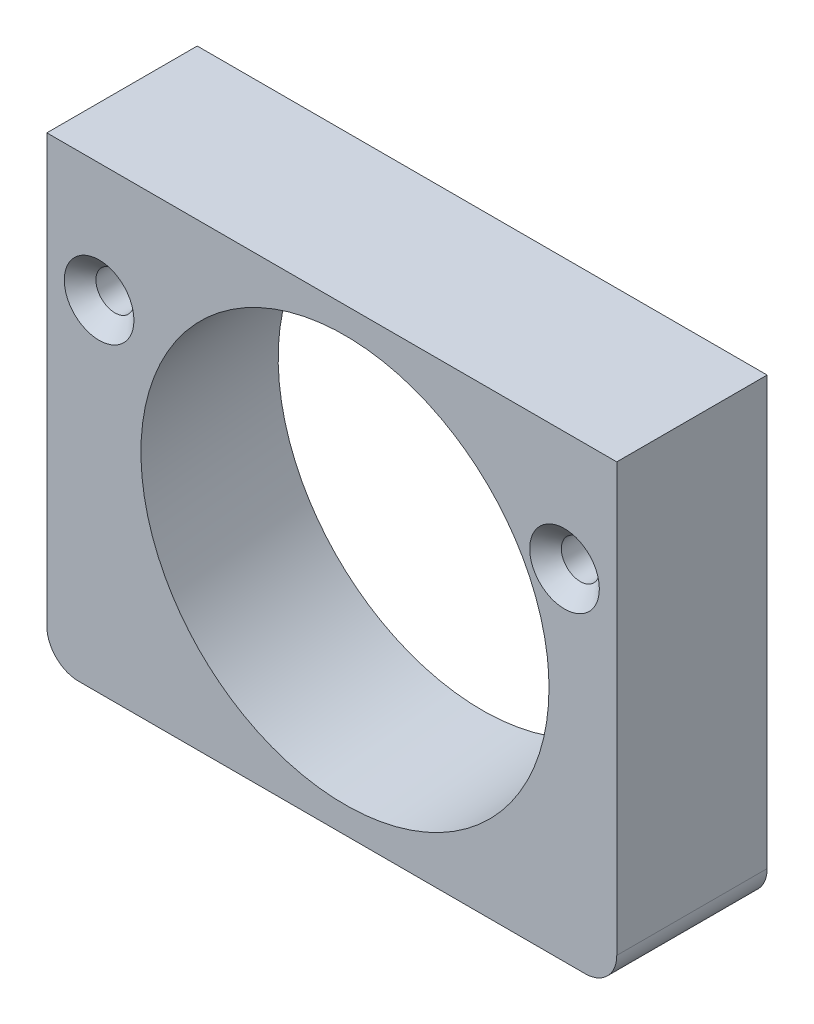
ISO-10303-21;
HEADER;
FILE_DESCRIPTION(('STEP AP214'),'2;1');
FILE_NAME('part.step','',(''),(''),'','','');
FILE_SCHEMA(('AUTOMOTIVE_DESIGN { 1 0 10303 214 1 1 1 1 }'));
ENDSEC;
DATA;
#1=APPLICATION_CONTEXT('core data for automotive mechanical design processes');
#2=APPLICATION_PROTOCOL_DEFINITION('international standard','automotive_design',2000,#1);
#3=PRODUCT_CONTEXT('',#1,'mechanical');
#4=PRODUCT('Part','Part','',(#3));
#5=PRODUCT_RELATED_PRODUCT_CATEGORY('part','',(#4));
#6=PRODUCT_DEFINITION_FORMATION('','',#4);
#7=PRODUCT_DEFINITION_CONTEXT('part definition',#1,'design');
#8=PRODUCT_DEFINITION('design','',#6,#7);
#9=PRODUCT_DEFINITION_SHAPE('','',#8);
#10=(LENGTH_UNIT() NAMED_UNIT(*) SI_UNIT(.MILLI.,.METRE.));
#11=(NAMED_UNIT(*) PLANE_ANGLE_UNIT() SI_UNIT($,.RADIAN.));
#12=(NAMED_UNIT(*) SI_UNIT($,.STERADIAN.) SOLID_ANGLE_UNIT());
#13=UNCERTAINTY_MEASURE_WITH_UNIT(LENGTH_MEASURE(1.E-05),#10,'distance_accuracy_value','');
#14=(GEOMETRIC_REPRESENTATION_CONTEXT(3) GLOBAL_UNCERTAINTY_ASSIGNED_CONTEXT((#13)) GLOBAL_UNIT_ASSIGNED_CONTEXT((#10,
#11,#12)) REPRESENTATION_CONTEXT('',''));
#15=CARTESIAN_POINT('',(0.,0.,0.));
#16=DIRECTION('',(0.,0.,1.));
#17=DIRECTION('',(1.,0.,0.));
#18=AXIS2_PLACEMENT_3D('',#15,#16,#17);
#19=CARTESIAN_POINT('',(-16.,-12.5,9.5));
#20=DIRECTION('',(0.,0.,-1.));
#21=DIRECTION('',(-1.,0.,0.));
#22=AXIS2_PLACEMENT_3D('',#19,#20,#21);
#23=PLANE('',#22);
#24=CARTESIAN_POINT('',(0.83114230349628,0.,9.5));
#25=DIRECTION('',(0.,0.,-1.));
#26=DIRECTION('',(1.,0.,0.));
#27=AXIS2_PLACEMENT_3D('',#24,#25,#26);
#28=ELLIPSE('',#27,12.8887455681053,12.8397);
#29=CARTESIAN_POINT('',(13.7198878716016,0.,9.5));
#30=VERTEX_POINT('',#29);
#31=EDGE_CURVE('E123',#30,#30,#28,.F.);
#32=ORIENTED_EDGE('',*,*,#31,.F.);
#33=EDGE_LOOP('',(#32));
#34=FACE_BOUND('',#33,.T.);
#35=DIRECTION('',(0.,1.,0.));
#36=VECTOR('',#35,1.);
#37=CARTESIAN_POINT('',(18.,-12.5,9.5));
#38=LINE('',#37,#36);
#39=CARTESIAN_POINT('',(18.,-12.5,9.5));
#40=VERTEX_POINT('',#39);
#41=CARTESIAN_POINT('',(18.,14.5,9.5));
#42=VERTEX_POINT('',#41);
#43=EDGE_CURVE('E130',#40,#42,#38,.T.);
#44=ORIENTED_EDGE('',*,*,#43,.T.);
#45=DIRECTION('',(-1.,0.,0.));
#46=VECTOR('',#45,1.);
#47=CARTESIAN_POINT('',(-18.,14.5,9.5));
#48=LINE('',#47,#46);
#49=CARTESIAN_POINT('',(-18.,14.5,9.5));
#50=VERTEX_POINT('',#49);
#51=EDGE_CURVE('E88',#42,#50,#48,.T.);
#52=ORIENTED_EDGE('',*,*,#51,.T.);
#53=DIRECTION('',(0.,-1.,0.));
#54=VECTOR('',#53,1.);
#55=CARTESIAN_POINT('',(-18.,-12.5,9.5));
#56=LINE('',#55,#54);
#57=CARTESIAN_POINT('',(-18.,-12.5,9.5));
#58=VERTEX_POINT('',#57);
#59=EDGE_CURVE('E101',#50,#58,#56,.T.);
#60=ORIENTED_EDGE('',*,*,#59,.T.);
#61=CARTESIAN_POINT('',(-16.,-12.5,9.5));
#62=DIRECTION('',(0.,0.,1.));
#63=DIRECTION('',(-1.,0.,0.));
#64=AXIS2_PLACEMENT_3D('',#61,#62,#63);
#65=CIRCLE('',#64,2.);
#66=CARTESIAN_POINT('',(-16.,-14.5,9.5));
#67=VERTEX_POINT('',#66);
#68=EDGE_CURVE('E95',#58,#67,#65,.T.);
#69=ORIENTED_EDGE('',*,*,#68,.T.);
#70=DIRECTION('',(1.,0.,0.));
#71=VECTOR('',#70,1.);
#72=CARTESIAN_POINT('',(-16.,-14.5,9.5));
#73=LINE('',#72,#71);
#74=CARTESIAN_POINT('',(16.,-14.5,9.5));
#75=VERTEX_POINT('',#74);
#76=EDGE_CURVE('E99',#67,#75,#73,.T.);
#77=ORIENTED_EDGE('',*,*,#76,.T.);
#78=CARTESIAN_POINT('',(16.,-12.5,9.5));
#79=DIRECTION('',(0.,0.,1.));
#80=DIRECTION('',(1.,0.,0.));
#81=AXIS2_PLACEMENT_3D('',#78,#79,#80);
#82=CIRCLE('',#81,2.);
#83=EDGE_CURVE('E51',#75,#40,#82,.T.);
#84=ORIENTED_EDGE('',*,*,#83,.T.);
#85=EDGE_LOOP('',(#44,#52,#60,#69,#77,#84));
#86=FACE_BOUND('',#85,.T.);
#87=CARTESIAN_POINT('',(14.7,7.,9.5));
#88=DIRECTION('',(0.,0.,1.));
#89=DIRECTION('',(1.,0.,0.));
#90=AXIS2_PLACEMENT_3D('',#87,#88,#89);
#91=CIRCLE('',#90,2.2);
#92=CARTESIAN_POINT('',(16.9,7.,9.5));
#93=VERTEX_POINT('',#92);
#94=EDGE_CURVE('E197',#93,#93,#91,.T.);
#95=ORIENTED_EDGE('',*,*,#94,.F.);
#96=EDGE_LOOP('',(#95));
#97=FACE_BOUND('',#96,.T.);
#98=CARTESIAN_POINT('',(-14.7,7.,9.5));
#99=DIRECTION('',(0.,0.,1.));
#100=DIRECTION('',(1.,0.,0.));
#101=AXIS2_PLACEMENT_3D('',#98,#99,#100);
#102=CIRCLE('',#101,2.2);
#103=CARTESIAN_POINT('',(-12.5,7.,9.5));
#104=VERTEX_POINT('',#103);
#105=EDGE_CURVE('E189',#104,#104,#102,.T.);
#106=ORIENTED_EDGE('',*,*,#105,.F.);
#107=EDGE_LOOP('',(#106));
#108=FACE_BOUND('',#107,.T.);
#109=ADVANCED_FACE('F34',(#34,#86,#97,#108),#23,.F.);
#110=CARTESIAN_POINT('',(18.,-12.5,9.5));
#111=DIRECTION('',(-1.,0.,0.));
#112=DIRECTION('',(0.,-1.,0.));
#113=AXIS2_PLACEMENT_3D('',#110,#111,#112);
#114=PLANE('',#113);
#115=DIRECTION('',(0.,1.,0.));
#116=VECTOR('',#115,1.);
#117=CARTESIAN_POINT('',(18.,-12.5,0.));
#118=LINE('',#117,#116);
#119=CARTESIAN_POINT('',(18.,-12.5,0.));
#120=VERTEX_POINT('',#119);
#121=CARTESIAN_POINT('',(18.,14.5,0.));
#122=VERTEX_POINT('',#121);
#123=EDGE_CURVE('E119',#120,#122,#118,.T.);
#124=ORIENTED_EDGE('',*,*,#123,.T.);
#125=DIRECTION('',(0.,0.,-1.));
#126=VECTOR('',#125,1.);
#127=CARTESIAN_POINT('',(18.,14.5,9.5));
#128=LINE('',#127,#126);
#129=EDGE_CURVE('E11',#42,#122,#128,.T.);
#130=ORIENTED_EDGE('',*,*,#129,.F.);
#131=ORIENTED_EDGE('',*,*,#43,.F.);
#132=DIRECTION('',(0.,0.,-1.));
#133=VECTOR('',#132,1.);
#134=CARTESIAN_POINT('',(18.,-12.5,9.5));
#135=LINE('',#134,#133);
#136=EDGE_CURVE('E115',#40,#120,#135,.T.);
#137=ORIENTED_EDGE('',*,*,#136,.T.);
#138=EDGE_LOOP('',(#124,#130,#131,#137));
#139=FACE_BOUND('',#138,.T.);
#140=ADVANCED_FACE('F36',(#139),#114,.F.);
#141=CARTESIAN_POINT('',(-18.,14.5,9.5));
#142=DIRECTION('',(0.,-1.,0.));
#143=DIRECTION('',(0.,0.,-1.));
#144=AXIS2_PLACEMENT_3D('',#141,#142,#143);
#145=PLANE('',#144);
#146=DIRECTION('',(-1.,0.,0.));
#147=VECTOR('',#146,1.);
#148=CARTESIAN_POINT('',(-18.,14.5,0.));
#149=LINE('',#148,#147);
#150=CARTESIAN_POINT('',(-18.,14.5,0.));
#151=VERTEX_POINT('',#150);
#152=EDGE_CURVE('E122',#122,#151,#149,.T.);
#153=ORIENTED_EDGE('',*,*,#152,.T.);
#154=DIRECTION('',(0.,0.,-1.));
#155=VECTOR('',#154,1.);
#156=CARTESIAN_POINT('',(-18.,14.5,9.5));
#157=LINE('',#156,#155);
#158=EDGE_CURVE('E43',#50,#151,#157,.T.);
#159=ORIENTED_EDGE('',*,*,#158,.F.);
#160=ORIENTED_EDGE('',*,*,#51,.F.);
#161=ORIENTED_EDGE('',*,*,#129,.T.);
#162=EDGE_LOOP('',(#153,#159,#160,#161));
#163=FACE_BOUND('',#162,.T.);
#164=ADVANCED_FACE('F160',(#163),#145,.F.);
#165=CARTESIAN_POINT('',(-18.,-12.5,9.5));
#166=DIRECTION('',(1.,0.,0.));
#167=DIRECTION('',(0.,1.,0.));
#168=AXIS2_PLACEMENT_3D('',#165,#166,#167);
#169=PLANE('',#168);
#170=DIRECTION('',(0.,-1.,0.));
#171=VECTOR('',#170,1.);
#172=CARTESIAN_POINT('',(-18.,-12.5,0.));
#173=LINE('',#172,#171);
#174=CARTESIAN_POINT('',(-18.,-12.5,0.));
#175=VERTEX_POINT('',#174);
#176=EDGE_CURVE('E125',#151,#175,#173,.T.);
#177=ORIENTED_EDGE('',*,*,#176,.T.);
#178=DIRECTION('',(0.,0.,-1.));
#179=VECTOR('',#178,1.);
#180=CARTESIAN_POINT('',(-18.,-12.5,9.5));
#181=LINE('',#180,#179);
#182=EDGE_CURVE('E110',#58,#175,#181,.T.);
#183=ORIENTED_EDGE('',*,*,#182,.F.);
#184=ORIENTED_EDGE('',*,*,#59,.F.);
#185=ORIENTED_EDGE('',*,*,#158,.T.);
#186=EDGE_LOOP('',(#177,#183,#184,#185));
#187=FACE_BOUND('',#186,.T.);
#188=ADVANCED_FACE('F136',(#187),#169,.F.);
#189=CARTESIAN_POINT('',(-16.,-12.5,9.5));
#190=DIRECTION('',(0.,0.,-1.));
#191=DIRECTION('',(-1.,0.,0.));
#192=AXIS2_PLACEMENT_3D('',#189,#190,#191);
#193=CYLINDRICAL_SURFACE('',#192,2.);
#194=CARTESIAN_POINT('',(-16.,-12.5,0.));
#195=DIRECTION('',(0.,0.,1.));
#196=DIRECTION('',(-1.,0.,0.));
#197=AXIS2_PLACEMENT_3D('',#194,#195,#196);
#198=CIRCLE('',#197,2.);
#199=CARTESIAN_POINT('',(-16.,-14.5,0.));
#200=VERTEX_POINT('',#199);
#201=EDGE_CURVE('E109',#175,#200,#198,.T.);
#202=ORIENTED_EDGE('',*,*,#201,.T.);
#203=DIRECTION('',(0.,0.,-1.));
#204=VECTOR('',#203,1.);
#205=CARTESIAN_POINT('',(-16.,-14.5,9.5));
#206=LINE('',#205,#204);
#207=EDGE_CURVE('E106',#67,#200,#206,.T.);
#208=ORIENTED_EDGE('',*,*,#207,.F.);
#209=ORIENTED_EDGE('',*,*,#68,.F.);
#210=ORIENTED_EDGE('',*,*,#182,.T.);
#211=EDGE_LOOP('',(#202,#208,#209,#210));
#212=FACE_BOUND('',#211,.T.);
#213=ADVANCED_FACE('F107',(#212),#193,.T.);
#214=CARTESIAN_POINT('',(-16.,-14.5,9.5));
#215=DIRECTION('',(0.,1.,0.));
#216=DIRECTION('',(0.,0.,1.));
#217=AXIS2_PLACEMENT_3D('',#214,#215,#216);
#218=PLANE('',#217);
#219=DIRECTION('',(1.,0.,0.));
#220=VECTOR('',#219,1.);
#221=CARTESIAN_POINT('',(-16.,-14.5,0.));
#222=LINE('',#221,#220);
#223=CARTESIAN_POINT('',(16.,-14.5,0.));
#224=VERTEX_POINT('',#223);
#225=EDGE_CURVE('E74',#200,#224,#222,.T.);
#226=ORIENTED_EDGE('',*,*,#225,.T.);
#227=DIRECTION('',(0.,0.,-1.));
#228=VECTOR('',#227,1.);
#229=CARTESIAN_POINT('',(16.,-14.5,9.5));
#230=LINE('',#229,#228);
#231=EDGE_CURVE('E111',#75,#224,#230,.T.);
#232=ORIENTED_EDGE('',*,*,#231,.F.);
#233=ORIENTED_EDGE('',*,*,#76,.F.);
#234=ORIENTED_EDGE('',*,*,#207,.T.);
#235=EDGE_LOOP('',(#226,#232,#233,#234));
#236=FACE_BOUND('',#235,.T.);
#237=ADVANCED_FACE('F113',(#236),#218,.F.);
#238=CARTESIAN_POINT('',(16.,-12.5,9.5));
#239=DIRECTION('',(0.,0.,-1.));
#240=DIRECTION('',(-1.,0.,0.));
#241=AXIS2_PLACEMENT_3D('',#238,#239,#240);
#242=CYLINDRICAL_SURFACE('',#241,2.);
#243=CARTESIAN_POINT('',(16.,-12.5,0.));
#244=DIRECTION('',(0.,0.,1.));
#245=DIRECTION('',(1.,0.,0.));
#246=AXIS2_PLACEMENT_3D('',#243,#244,#245);
#247=CIRCLE('',#246,2.);
#248=EDGE_CURVE('E80',#224,#120,#247,.T.);
#249=ORIENTED_EDGE('',*,*,#248,.T.);
#250=ORIENTED_EDGE('',*,*,#136,.F.);
#251=ORIENTED_EDGE('',*,*,#83,.F.);
#252=ORIENTED_EDGE('',*,*,#231,.T.);
#253=EDGE_LOOP('',(#249,#250,#251,#252));
#254=FACE_BOUND('',#253,.T.);
#255=ADVANCED_FACE('F143',(#254),#242,.T.);
#256=CARTESIAN_POINT('',(-16.,-12.5,0.));
#257=DIRECTION('',(0.,0.,-1.));
#258=DIRECTION('',(-1.,0.,0.));
#259=AXIS2_PLACEMENT_3D('',#256,#257,#258);
#260=PLANE('',#259);
#261=CARTESIAN_POINT('',(-14.7,7.,0.));
#262=DIRECTION('',(0.,0.,-1.));
#263=DIRECTION('',(-1.,0.,0.));
#264=AXIS2_PLACEMENT_3D('',#261,#262,#263);
#265=CIRCLE('',#264,1.2);
#266=CARTESIAN_POINT('',(-15.9,7.,0.));
#267=VERTEX_POINT('',#266);
#268=EDGE_CURVE('E192',#267,#267,#265,.T.);
#269=ORIENTED_EDGE('',*,*,#268,.F.);
#270=EDGE_LOOP('',(#269));
#271=FACE_BOUND('',#270,.T.);
#272=CARTESIAN_POINT('',(14.7,7.,0.));
#273=DIRECTION('',(0.,0.,-1.));
#274=DIRECTION('',(-1.,0.,0.));
#275=AXIS2_PLACEMENT_3D('',#272,#273,#274);
#276=CIRCLE('',#275,1.2);
#277=CARTESIAN_POINT('',(13.5,7.,0.));
#278=VERTEX_POINT('',#277);
#279=EDGE_CURVE('E203',#278,#278,#276,.T.);
#280=ORIENTED_EDGE('',*,*,#279,.F.);
#281=EDGE_LOOP('',(#280));
#282=FACE_BOUND('',#281,.T.);
#283=CARTESIAN_POINT('',(0.,0.,0.));
#284=DIRECTION('',(0.,0.,-1.));
#285=DIRECTION('',(1.,0.,0.));
#286=AXIS2_PLACEMENT_3D('',#283,#284,#285);
#287=ELLIPSE('',#286,12.8887455681053,12.8397);
#288=CARTESIAN_POINT('',(12.8887455681053,0.,0.));
#289=VERTEX_POINT('',#288);
#290=EDGE_CURVE('E206',#289,#289,#287,.F.);
#291=ORIENTED_EDGE('',*,*,#290,.T.);
#292=EDGE_LOOP('',(#291));
#293=FACE_BOUND('',#292,.T.);
#294=ORIENTED_EDGE('',*,*,#123,.F.);
#295=ORIENTED_EDGE('',*,*,#248,.F.);
#296=ORIENTED_EDGE('',*,*,#225,.F.);
#297=ORIENTED_EDGE('',*,*,#201,.F.);
#298=ORIENTED_EDGE('',*,*,#176,.F.);
#299=ORIENTED_EDGE('',*,*,#152,.F.);
#300=EDGE_LOOP('',(#294,#295,#296,#297,#298,#299));
#301=FACE_BOUND('',#300,.T.);
#302=ADVANCED_FACE('F139',(#271,#282,#293,#301),#260,.T.);
#303=CARTESIAN_POINT('',(-0.136824643102456,0.,-1.56391282696772));
#304=DIRECTION('',(0.0871557427476584,0.,0.996194698091746));
#305=DIRECTION('',(0.996194698091746,0.,-0.0871557427476584));
#306=AXIS2_PLACEMENT_3D('',#303,#304,#305);
#307=CYLINDRICAL_SURFACE('',#306,12.8397);
#308=ORIENTED_EDGE('',*,*,#290,.F.);
#309=EDGE_LOOP('',(#308));
#310=FACE_BOUND('',#309,.T.);
#311=ORIENTED_EDGE('',*,*,#31,.T.);
#312=EDGE_LOOP('',(#311));
#313=FACE_BOUND('',#312,.T.);
#314=ADVANCED_FACE('F150',(#310,#313),#307,.F.);
#315=CARTESIAN_POINT('',(14.7,7.,9.5));
#316=DIRECTION('',(0.,0.,1.));
#317=DIRECTION('',(1.,0.,0.));
#318=AXIS2_PLACEMENT_3D('',#315,#316,#317);
#319=CYLINDRICAL_SURFACE('',#318,1.2);
#320=CARTESIAN_POINT('',(14.7,7.,8.5));
#321=DIRECTION('',(0.,0.,1.));
#322=DIRECTION('',(1.,0.,0.));
#323=AXIS2_PLACEMENT_3D('',#320,#321,#322);
#324=CIRCLE('',#323,1.2);
#325=CARTESIAN_POINT('',(15.9,7.,8.5));
#326=VERTEX_POINT('',#325);
#327=EDGE_CURVE('E200',#326,#326,#324,.T.);
#328=ORIENTED_EDGE('',*,*,#327,.T.);
#329=EDGE_LOOP('',(#328));
#330=FACE_BOUND('',#329,.T.);
#331=ORIENTED_EDGE('',*,*,#279,.T.);
#332=EDGE_LOOP('',(#331));
#333=FACE_BOUND('',#332,.T.);
#334=ADVANCED_FACE('F165',(#330,#333),#319,.F.);
#335=CARTESIAN_POINT('',(14.7,7.,9.5));
#336=DIRECTION('',(0.,0.,1.));
#337=DIRECTION('',(1.,0.,0.));
#338=AXIS2_PLACEMENT_3D('',#335,#336,#337);
#339=CONICAL_SURFACE('',#338,2.2,0.785398163397447);
#340=ORIENTED_EDGE('',*,*,#327,.F.);
#341=EDGE_LOOP('',(#340));
#342=FACE_BOUND('',#341,.T.);
#343=ORIENTED_EDGE('',*,*,#94,.T.);
#344=EDGE_LOOP('',(#343));
#345=FACE_BOUND('',#344,.T.);
#346=ADVANCED_FACE('F169',(#342,#345),#339,.F.);
#347=CARTESIAN_POINT('',(-14.7,7.,9.5));
#348=DIRECTION('',(0.,0.,1.));
#349=DIRECTION('',(1.,0.,0.));
#350=AXIS2_PLACEMENT_3D('',#347,#348,#349);
#351=CYLINDRICAL_SURFACE('',#350,1.2);
#352=CARTESIAN_POINT('',(-14.7,7.,8.5));
#353=DIRECTION('',(0.,0.,1.));
#354=DIRECTION('',(1.,0.,0.));
#355=AXIS2_PLACEMENT_3D('',#352,#353,#354);
#356=CIRCLE('',#355,1.2);
#357=CARTESIAN_POINT('',(-13.5,7.,8.5));
#358=VERTEX_POINT('',#357);
#359=EDGE_CURVE('E186',#358,#358,#356,.T.);
#360=ORIENTED_EDGE('',*,*,#359,.T.);
#361=EDGE_LOOP('',(#360));
#362=FACE_BOUND('',#361,.T.);
#363=ORIENTED_EDGE('',*,*,#268,.T.);
#364=EDGE_LOOP('',(#363));
#365=FACE_BOUND('',#364,.T.);
#366=ADVANCED_FACE('F173',(#362,#365),#351,.F.);
#367=CARTESIAN_POINT('',(-14.7,7.,9.5));
#368=DIRECTION('',(0.,0.,1.));
#369=DIRECTION('',(1.,0.,0.));
#370=AXIS2_PLACEMENT_3D('',#367,#368,#369);
#371=CONICAL_SURFACE('',#370,2.2,0.785398163397447);
#372=ORIENTED_EDGE('',*,*,#359,.F.);
#373=EDGE_LOOP('',(#372));
#374=FACE_BOUND('',#373,.T.);
#375=ORIENTED_EDGE('',*,*,#105,.T.);
#376=EDGE_LOOP('',(#375));
#377=FACE_BOUND('',#376,.T.);
#378=ADVANCED_FACE('F177',(#374,#377),#371,.F.);
#379=CLOSED_SHELL('',(#109,#140,#164,#188,#213,#237,#255,#302,#314,#334,#346,#366,#378));
#380=MANIFOLD_SOLID_BREP('B2',#379);
#381=ADVANCED_BREP_SHAPE_REPRESENTATION('',(#18,#380),#14);
#382=SHAPE_DEFINITION_REPRESENTATION(#9,#381);
ENDSEC;
END-ISO-10303-21;
